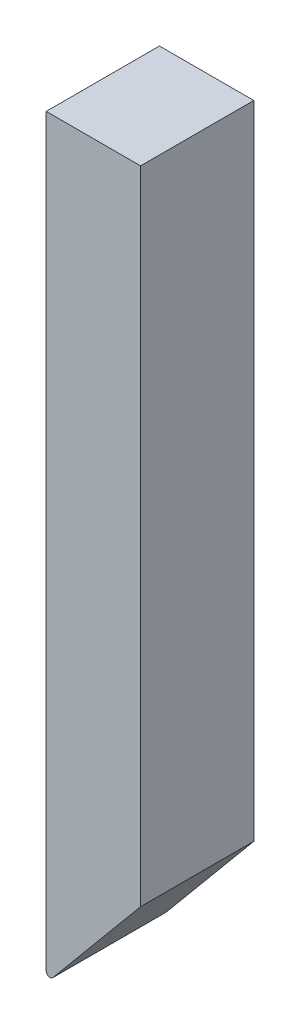
ISO-10303-21;
HEADER;
FILE_DESCRIPTION(('STEP AP214'),'2;1');
FILE_NAME('part.step','',(''),(''),'','','');
FILE_SCHEMA(('AUTOMOTIVE_DESIGN { 1 0 10303 214 1 1 1 1 }'));
ENDSEC;
DATA;
#1=APPLICATION_CONTEXT('core data for automotive mechanical design processes');
#2=APPLICATION_PROTOCOL_DEFINITION('international standard','automotive_design',2000,#1);
#3=PRODUCT_CONTEXT('',#1,'mechanical');
#4=PRODUCT('Part','Part','',(#3));
#5=PRODUCT_RELATED_PRODUCT_CATEGORY('part','',(#4));
#6=PRODUCT_DEFINITION_FORMATION('','',#4);
#7=PRODUCT_DEFINITION_CONTEXT('part definition',#1,'design');
#8=PRODUCT_DEFINITION('design','',#6,#7);
#9=PRODUCT_DEFINITION_SHAPE('','',#8);
#10=(LENGTH_UNIT() NAMED_UNIT(*) SI_UNIT(.MILLI.,.METRE.));
#11=(NAMED_UNIT(*) PLANE_ANGLE_UNIT() SI_UNIT($,.RADIAN.));
#12=(NAMED_UNIT(*) SI_UNIT($,.STERADIAN.) SOLID_ANGLE_UNIT());
#13=UNCERTAINTY_MEASURE_WITH_UNIT(LENGTH_MEASURE(1.E-05),#10,'distance_accuracy_value','');
#14=(GEOMETRIC_REPRESENTATION_CONTEXT(3) GLOBAL_UNCERTAINTY_ASSIGNED_CONTEXT((#13)) GLOBAL_UNIT_ASSIGNED_CONTEXT((#10,
#11,#12)) REPRESENTATION_CONTEXT('',''));
#15=CARTESIAN_POINT('',(0.,0.,0.));
#16=DIRECTION('',(0.,0.,1.));
#17=DIRECTION('',(1.,0.,0.));
#18=AXIS2_PLACEMENT_3D('',#15,#16,#17);
#19=CARTESIAN_POINT('',(-1.25,7.5,3.));
#20=DIRECTION('',(1.,0.,0.));
#21=DIRECTION('',(0.,1.,0.));
#22=AXIS2_PLACEMENT_3D('',#19,#20,#21);
#23=PLANE('',#22);
#24=DIRECTION('',(0.,-1.,0.));
#25=VECTOR('',#24,1.);
#26=CARTESIAN_POINT('',(-1.25,7.5,0.));
#27=LINE('',#26,#25);
#28=CARTESIAN_POINT('',(-1.25,7.5,0.));
#29=VERTEX_POINT('',#28);
#30=CARTESIAN_POINT('',(-1.25,-12.2237950064819,0.));
#31=VERTEX_POINT('',#30);
#32=EDGE_CURVE('E120',#29,#31,#27,.T.);
#33=ORIENTED_EDGE('',*,*,#32,.T.);
#34=DIRECTION('',(0.,0.,-1.));
#35=VECTOR('',#34,1.);
#36=CARTESIAN_POINT('',(-1.25,-12.2237950064819,3.));
#37=LINE('',#36,#35);
#38=CARTESIAN_POINT('',(-1.25,-12.2237950064819,3.));
#39=VERTEX_POINT('',#38);
#40=EDGE_CURVE('E48',#31,#39,#37,.F.);
#41=ORIENTED_EDGE('',*,*,#40,.T.);
#42=DIRECTION('',(0.,-1.,0.));
#43=VECTOR('',#42,1.);
#44=CARTESIAN_POINT('',(-1.25,7.5,3.));
#45=LINE('',#44,#43);
#46=CARTESIAN_POINT('',(-1.25,7.5,3.));
#47=VERTEX_POINT('',#46);
#48=EDGE_CURVE('E97',#47,#39,#45,.T.);
#49=ORIENTED_EDGE('',*,*,#48,.F.);
#50=DIRECTION('',(0.,0.,-1.));
#51=VECTOR('',#50,1.);
#52=CARTESIAN_POINT('',(-1.25,7.5,3.));
#53=LINE('',#52,#51);
#54=EDGE_CURVE('E116',#47,#29,#53,.T.);
#55=ORIENTED_EDGE('',*,*,#54,.T.);
#56=EDGE_LOOP('',(#33,#41,#49,#55));
#57=FACE_BOUND('',#56,.T.);
#58=ADVANCED_FACE('F39',(#57),#23,.F.);
#59=CARTESIAN_POINT('',(-1.25,-12.5,3.));
#60=DIRECTION('',(-0.768221279597376,0.64018439966448,0.));
#61=DIRECTION('',(-0.64018439966448,-0.768221279597376,0.));
#62=AXIS2_PLACEMENT_3D('',#59,#60,#61);
#63=PLANE('',#62);
#64=DIRECTION('',(0.64018439966448,0.768221279597376,0.));
#65=VECTOR('',#64,1.);
#66=CARTESIAN_POINT('',(-1.25,-12.5,3.));
#67=LINE('',#66,#65);
#68=CARTESIAN_POINT('',(-1.07317787204026,-12.2878134464483,3.));
#69=VERTEX_POINT('',#68);
#70=CARTESIAN_POINT('',(1.25,-9.5,3.));
#71=VERTEX_POINT('',#70);
#72=EDGE_CURVE('E86',#69,#71,#67,.T.);
#73=ORIENTED_EDGE('',*,*,#72,.F.);
#74=DIRECTION('',(0.,0.,-1.));
#75=VECTOR('',#74,1.);
#76=CARTESIAN_POINT('',(-1.07317787204026,-12.2878134464483,3.));
#77=LINE('',#76,#75);
#78=CARTESIAN_POINT('',(-1.07317787204026,-12.2878134464483,0.));
#79=VERTEX_POINT('',#78);
#80=EDGE_CURVE('E106',#69,#79,#77,.T.);
#81=ORIENTED_EDGE('',*,*,#80,.T.);
#82=DIRECTION('',(0.64018439966448,0.768221279597376,0.));
#83=VECTOR('',#82,1.);
#84=CARTESIAN_POINT('',(-1.25,-12.5,0.));
#85=LINE('',#84,#83);
#86=CARTESIAN_POINT('',(1.25,-9.5,0.));
#87=VERTEX_POINT('',#86);
#88=EDGE_CURVE('E102',#79,#87,#85,.T.);
#89=ORIENTED_EDGE('',*,*,#88,.T.);
#90=DIRECTION('',(0.,0.,-1.));
#91=VECTOR('',#90,1.);
#92=CARTESIAN_POINT('',(1.25,-9.5,3.));
#93=LINE('',#92,#91);
#94=EDGE_CURVE('E100',#71,#87,#93,.T.);
#95=ORIENTED_EDGE('',*,*,#94,.F.);
#96=EDGE_LOOP('',(#73,#81,#89,#95));
#97=FACE_BOUND('',#96,.T.);
#98=ADVANCED_FACE('F101',(#97),#63,.F.);
#99=CARTESIAN_POINT('',(1.25,7.5,3.));
#100=DIRECTION('',(-1.,0.,0.));
#101=DIRECTION('',(0.,-1.,0.));
#102=AXIS2_PLACEMENT_3D('',#99,#100,#101);
#103=PLANE('',#102);
#104=DIRECTION('',(0.,1.,0.));
#105=VECTOR('',#104,1.);
#106=CARTESIAN_POINT('',(1.25,7.5,0.));
#107=LINE('',#106,#105);
#108=CARTESIAN_POINT('',(1.25,7.5,0.));
#109=VERTEX_POINT('',#108);
#110=EDGE_CURVE('E125',#87,#109,#107,.T.);
#111=ORIENTED_EDGE('',*,*,#110,.T.);
#112=DIRECTION('',(0.,0.,-1.));
#113=VECTOR('',#112,1.);
#114=CARTESIAN_POINT('',(1.25,7.5,3.));
#115=LINE('',#114,#113);
#116=CARTESIAN_POINT('',(1.25,7.5,3.));
#117=VERTEX_POINT('',#116);
#118=EDGE_CURVE('E107',#117,#109,#115,.T.);
#119=ORIENTED_EDGE('',*,*,#118,.F.);
#120=DIRECTION('',(0.,1.,0.));
#121=VECTOR('',#120,1.);
#122=CARTESIAN_POINT('',(1.25,7.5,3.));
#123=LINE('',#122,#121);
#124=EDGE_CURVE('E90',#71,#117,#123,.T.);
#125=ORIENTED_EDGE('',*,*,#124,.F.);
#126=ORIENTED_EDGE('',*,*,#94,.T.);
#127=EDGE_LOOP('',(#111,#119,#125,#126));
#128=FACE_BOUND('',#127,.T.);
#129=ADVANCED_FACE('F109',(#128),#103,.F.);
#130=CARTESIAN_POINT('',(-1.25,7.5,3.));
#131=DIRECTION('',(0.,-1.,0.));
#132=DIRECTION('',(0.,0.,-1.));
#133=AXIS2_PLACEMENT_3D('',#130,#131,#132);
#134=PLANE('',#133);
#135=DIRECTION('',(-1.,0.,0.));
#136=VECTOR('',#135,1.);
#137=CARTESIAN_POINT('',(-1.25,7.5,0.));
#138=LINE('',#137,#136);
#139=EDGE_CURVE('E128',#109,#29,#138,.T.);
#140=ORIENTED_EDGE('',*,*,#139,.T.);
#141=ORIENTED_EDGE('',*,*,#54,.F.);
#142=DIRECTION('',(-1.,0.,0.));
#143=VECTOR('',#142,1.);
#144=CARTESIAN_POINT('',(-1.25,7.5,3.));
#145=LINE('',#144,#143);
#146=EDGE_CURVE('E113',#117,#47,#145,.T.);
#147=ORIENTED_EDGE('',*,*,#146,.F.);
#148=ORIENTED_EDGE('',*,*,#118,.T.);
#149=EDGE_LOOP('',(#140,#141,#147,#148));
#150=FACE_BOUND('',#149,.T.);
#151=ADVANCED_FACE('F144',(#150),#134,.F.);
#152=CARTESIAN_POINT('',(0.,0.,3.));
#153=DIRECTION('',(0.,0.,1.));
#154=DIRECTION('',(1.,0.,0.));
#155=AXIS2_PLACEMENT_3D('',#152,#153,#154);
#156=PLANE('',#155);
#157=ORIENTED_EDGE('',*,*,#48,.T.);
#158=CARTESIAN_POINT('',(-1.15,-12.2237950064819,3.));
#159=DIRECTION('',(0.,0.,1.));
#160=DIRECTION('',(1.,0.,0.));
#161=AXIS2_PLACEMENT_3D('',#158,#159,#160);
#162=CIRCLE('',#161,0.1);
#163=EDGE_CURVE('E11',#39,#69,#162,.T.);
#164=ORIENTED_EDGE('',*,*,#163,.T.);
#165=ORIENTED_EDGE('',*,*,#72,.T.);
#166=ORIENTED_EDGE('',*,*,#124,.T.);
#167=ORIENTED_EDGE('',*,*,#146,.T.);
#168=EDGE_LOOP('',(#157,#164,#165,#166,#167));
#169=FACE_BOUND('',#168,.T.);
#170=ADVANCED_FACE('F88',(#169),#156,.T.);
#171=CARTESIAN_POINT('',(0.,0.,0.));
#172=DIRECTION('',(0.,0.,1.));
#173=DIRECTION('',(1.,0.,0.));
#174=AXIS2_PLACEMENT_3D('',#171,#172,#173);
#175=PLANE('',#174);
#176=ORIENTED_EDGE('',*,*,#88,.F.);
#177=CARTESIAN_POINT('',(-1.15,-12.2237950064819,0.));
#178=DIRECTION('',(0.,0.,1.));
#179=DIRECTION('',(1.,0.,0.));
#180=AXIS2_PLACEMENT_3D('',#177,#178,#179);
#181=CIRCLE('',#180,0.1);
#182=EDGE_CURVE('E62',#79,#31,#181,.F.);
#183=ORIENTED_EDGE('',*,*,#182,.T.);
#184=ORIENTED_EDGE('',*,*,#32,.F.);
#185=ORIENTED_EDGE('',*,*,#139,.F.);
#186=ORIENTED_EDGE('',*,*,#110,.F.);
#187=EDGE_LOOP('',(#176,#183,#184,#185,#186));
#188=FACE_BOUND('',#187,.T.);
#189=ADVANCED_FACE('F141',(#188),#175,.F.);
#190=CARTESIAN_POINT('',(-1.15,-12.2237950064819,3.));
#191=DIRECTION('',(0.,0.,-1.));
#192=DIRECTION('',(-1.,0.,0.));
#193=AXIS2_PLACEMENT_3D('',#190,#191,#192);
#194=CYLINDRICAL_SURFACE('',#193,0.1);
#195=ORIENTED_EDGE('',*,*,#163,.F.);
#196=ORIENTED_EDGE('',*,*,#40,.F.);
#197=ORIENTED_EDGE('',*,*,#182,.F.);
#198=ORIENTED_EDGE('',*,*,#80,.F.);
#199=EDGE_LOOP('',(#195,#196,#197,#198));
#200=FACE_BOUND('',#199,.T.);
#201=ADVANCED_FACE('F41',(#200),#194,.T.);
#202=CLOSED_SHELL('',(#58,#98,#129,#151,#170,#189,#201));
#203=MANIFOLD_SOLID_BREP('B2',#202);
#204=ADVANCED_BREP_SHAPE_REPRESENTATION('',(#18,#203),#14);
#205=SHAPE_DEFINITION_REPRESENTATION(#9,#204);
ENDSEC;
END-ISO-10303-21;
